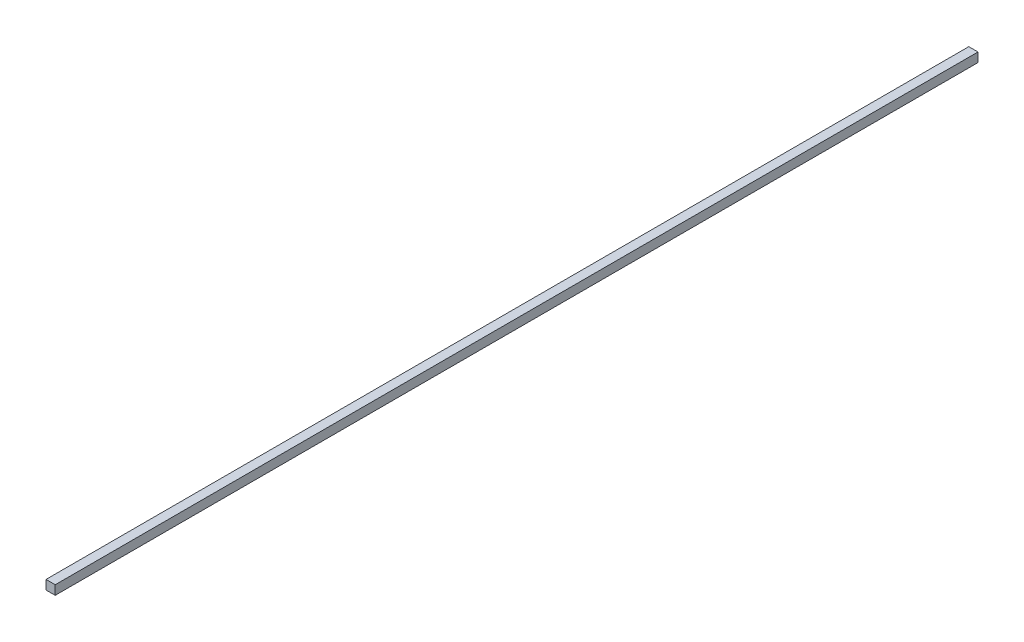
ISO-10303-21;
HEADER;
FILE_DESCRIPTION(('STEP AP214'),'2;1');
FILE_NAME('part.step','',(''),(''),'','','');
FILE_SCHEMA(('AUTOMOTIVE_DESIGN { 1 0 10303 214 1 1 1 1 }'));
ENDSEC;
DATA;
#1=APPLICATION_CONTEXT('core data for automotive mechanical design processes');
#2=APPLICATION_PROTOCOL_DEFINITION('international standard','automotive_design',2000,#1);
#3=PRODUCT_CONTEXT('',#1,'mechanical');
#4=PRODUCT('Part','Part','',(#3));
#5=PRODUCT_RELATED_PRODUCT_CATEGORY('part','',(#4));
#6=PRODUCT_DEFINITION_FORMATION('','',#4);
#7=PRODUCT_DEFINITION_CONTEXT('part definition',#1,'design');
#8=PRODUCT_DEFINITION('design','',#6,#7);
#9=PRODUCT_DEFINITION_SHAPE('','',#8);
#10=(LENGTH_UNIT() NAMED_UNIT(*) SI_UNIT(.MILLI.,.METRE.));
#11=(NAMED_UNIT(*) PLANE_ANGLE_UNIT() SI_UNIT($,.RADIAN.));
#12=(NAMED_UNIT(*) SI_UNIT($,.STERADIAN.) SOLID_ANGLE_UNIT());
#13=UNCERTAINTY_MEASURE_WITH_UNIT(LENGTH_MEASURE(1.E-05),#10,'distance_accuracy_value','');
#14=(GEOMETRIC_REPRESENTATION_CONTEXT(3) GLOBAL_UNCERTAINTY_ASSIGNED_CONTEXT((#13)) GLOBAL_UNIT_ASSIGNED_CONTEXT((#10,
#11,#12)) REPRESENTATION_CONTEXT('',''));
#15=CARTESIAN_POINT('',(0.,0.,0.));
#16=DIRECTION('',(0.,0.,1.));
#17=DIRECTION('',(1.,0.,0.));
#18=AXIS2_PLACEMENT_3D('',#15,#16,#17);
#19=CARTESIAN_POINT('',(3.8,-3.8,762.));
#20=DIRECTION('',(-1.,0.,0.));
#21=DIRECTION('',(0.,0.,1.));
#22=AXIS2_PLACEMENT_3D('',#19,#20,#21);
#23=PLANE('',#22);
#24=DIRECTION('',(0.,1.,0.));
#25=VECTOR('',#24,1.);
#26=CARTESIAN_POINT('',(3.8,-3.8,0.));
#27=LINE('',#26,#25);
#28=CARTESIAN_POINT('',(3.8,-3.8,0.));
#29=VERTEX_POINT('',#28);
#30=CARTESIAN_POINT('',(3.8,3.8,0.));
#31=VERTEX_POINT('',#30);
#32=EDGE_CURVE('E97',#29,#31,#27,.T.);
#33=ORIENTED_EDGE('',*,*,#32,.T.);
#34=DIRECTION('',(0.,0.,-1.));
#35=VECTOR('',#34,1.);
#36=CARTESIAN_POINT('',(3.8,3.8,762.));
#37=LINE('',#36,#35);
#38=CARTESIAN_POINT('',(3.8,3.8,762.));
#39=VERTEX_POINT('',#38);
#40=EDGE_CURVE('E11',#39,#31,#37,.T.);
#41=ORIENTED_EDGE('',*,*,#40,.F.);
#42=DIRECTION('',(0.,1.,0.));
#43=VECTOR('',#42,1.);
#44=CARTESIAN_POINT('',(3.8,-3.8,762.));
#45=LINE('',#44,#43);
#46=CARTESIAN_POINT('',(3.8,-3.8,762.));
#47=VERTEX_POINT('',#46);
#48=EDGE_CURVE('E85',#47,#39,#45,.T.);
#49=ORIENTED_EDGE('',*,*,#48,.F.);
#50=DIRECTION('',(0.,0.,-1.));
#51=VECTOR('',#50,1.);
#52=CARTESIAN_POINT('',(3.8,-3.8,762.));
#53=LINE('',#52,#51);
#54=EDGE_CURVE('E93',#47,#29,#53,.T.);
#55=ORIENTED_EDGE('',*,*,#54,.T.);
#56=EDGE_LOOP('',(#33,#41,#49,#55));
#57=FACE_BOUND('',#56,.T.);
#58=ADVANCED_FACE('F34',(#57),#23,.F.);
#59=CARTESIAN_POINT('',(-3.8,3.8,762.));
#60=DIRECTION('',(0.,-1.,0.));
#61=DIRECTION('',(0.,0.,-1.));
#62=AXIS2_PLACEMENT_3D('',#59,#60,#61);
#63=PLANE('',#62);
#64=DIRECTION('',(-1.,0.,0.));
#65=VECTOR('',#64,1.);
#66=CARTESIAN_POINT('',(-3.8,3.8,0.));
#67=LINE('',#66,#65);
#68=CARTESIAN_POINT('',(-3.8,3.8,0.));
#69=VERTEX_POINT('',#68);
#70=EDGE_CURVE('E89',#31,#69,#67,.T.);
#71=ORIENTED_EDGE('',*,*,#70,.T.);
#72=DIRECTION('',(0.,0.,-1.));
#73=VECTOR('',#72,1.);
#74=CARTESIAN_POINT('',(-3.8,3.8,762.));
#75=LINE('',#74,#73);
#76=CARTESIAN_POINT('',(-3.8,3.8,762.));
#77=VERTEX_POINT('',#76);
#78=EDGE_CURVE('E42',#77,#69,#75,.T.);
#79=ORIENTED_EDGE('',*,*,#78,.F.);
#80=DIRECTION('',(-1.,0.,0.));
#81=VECTOR('',#80,1.);
#82=CARTESIAN_POINT('',(-3.8,3.8,762.));
#83=LINE('',#82,#81);
#84=EDGE_CURVE('E80',#39,#77,#83,.T.);
#85=ORIENTED_EDGE('',*,*,#84,.F.);
#86=ORIENTED_EDGE('',*,*,#40,.T.);
#87=EDGE_LOOP('',(#71,#79,#85,#86));
#88=FACE_BOUND('',#87,.T.);
#89=ADVANCED_FACE('F88',(#88),#63,.F.);
#90=CARTESIAN_POINT('',(-3.8,-3.8,762.));
#91=DIRECTION('',(1.,0.,0.));
#92=DIRECTION('',(0.,0.,-1.));
#93=AXIS2_PLACEMENT_3D('',#90,#91,#92);
#94=PLANE('',#93);
#95=DIRECTION('',(0.,-1.,0.));
#96=VECTOR('',#95,1.);
#97=CARTESIAN_POINT('',(-3.8,-3.8,0.));
#98=LINE('',#97,#96);
#99=CARTESIAN_POINT('',(-3.8,-3.8,0.));
#100=VERTEX_POINT('',#99);
#101=EDGE_CURVE('E67',#69,#100,#98,.T.);
#102=ORIENTED_EDGE('',*,*,#101,.T.);
#103=DIRECTION('',(0.,0.,-1.));
#104=VECTOR('',#103,1.);
#105=CARTESIAN_POINT('',(-3.8,-3.8,762.));
#106=LINE('',#105,#104);
#107=CARTESIAN_POINT('',(-3.8,-3.8,762.));
#108=VERTEX_POINT('',#107);
#109=EDGE_CURVE('E90',#108,#100,#106,.T.);
#110=ORIENTED_EDGE('',*,*,#109,.F.);
#111=DIRECTION('',(0.,-1.,0.));
#112=VECTOR('',#111,1.);
#113=CARTESIAN_POINT('',(-3.8,-3.8,762.));
#114=LINE('',#113,#112);
#115=EDGE_CURVE('E83',#77,#108,#114,.T.);
#116=ORIENTED_EDGE('',*,*,#115,.F.);
#117=ORIENTED_EDGE('',*,*,#78,.T.);
#118=EDGE_LOOP('',(#102,#110,#116,#117));
#119=FACE_BOUND('',#118,.T.);
#120=ADVANCED_FACE('F91',(#119),#94,.F.);
#121=CARTESIAN_POINT('',(-3.8,-3.8,762.));
#122=DIRECTION('',(0.,1.,0.));
#123=DIRECTION('',(0.,0.,1.));
#124=AXIS2_PLACEMENT_3D('',#121,#122,#123);
#125=PLANE('',#124);
#126=DIRECTION('',(1.,0.,0.));
#127=VECTOR('',#126,1.);
#128=CARTESIAN_POINT('',(-3.8,-3.8,0.));
#129=LINE('',#128,#127);
#130=EDGE_CURVE('E73',#100,#29,#129,.T.);
#131=ORIENTED_EDGE('',*,*,#130,.T.);
#132=ORIENTED_EDGE('',*,*,#54,.F.);
#133=DIRECTION('',(1.,0.,0.));
#134=VECTOR('',#133,1.);
#135=CARTESIAN_POINT('',(-3.8,-3.8,762.));
#136=LINE('',#135,#134);
#137=EDGE_CURVE('E50',#108,#47,#136,.T.);
#138=ORIENTED_EDGE('',*,*,#137,.F.);
#139=ORIENTED_EDGE('',*,*,#109,.T.);
#140=EDGE_LOOP('',(#131,#132,#138,#139));
#141=FACE_BOUND('',#140,.T.);
#142=ADVANCED_FACE('F104',(#141),#125,.F.);
#143=CARTESIAN_POINT('',(0.,0.,762.));
#144=DIRECTION('',(0.,0.,-1.));
#145=DIRECTION('',(-1.,0.,0.));
#146=AXIS2_PLACEMENT_3D('',#143,#144,#145);
#147=PLANE('',#146);
#148=ORIENTED_EDGE('',*,*,#48,.T.);
#149=ORIENTED_EDGE('',*,*,#84,.T.);
#150=ORIENTED_EDGE('',*,*,#115,.T.);
#151=ORIENTED_EDGE('',*,*,#137,.T.);
#152=EDGE_LOOP('',(#148,#149,#150,#151));
#153=FACE_BOUND('',#152,.T.);
#154=ADVANCED_FACE('F81',(#153),#147,.F.);
#155=CARTESIAN_POINT('',(0.,0.,0.));
#156=DIRECTION('',(0.,0.,-1.));
#157=DIRECTION('',(-1.,0.,0.));
#158=AXIS2_PLACEMENT_3D('',#155,#156,#157);
#159=PLANE('',#158);
#160=ORIENTED_EDGE('',*,*,#32,.F.);
#161=ORIENTED_EDGE('',*,*,#130,.F.);
#162=ORIENTED_EDGE('',*,*,#101,.F.);
#163=ORIENTED_EDGE('',*,*,#70,.F.);
#164=EDGE_LOOP('',(#160,#161,#162,#163));
#165=FACE_BOUND('',#164,.T.);
#166=ADVANCED_FACE('F107',(#165),#159,.T.);
#167=CLOSED_SHELL('',(#58,#89,#120,#142,#154,#166));
#168=MANIFOLD_SOLID_BREP('B2',#167);
#169=ADVANCED_BREP_SHAPE_REPRESENTATION('',(#18,#168),#14);
#170=SHAPE_DEFINITION_REPRESENTATION(#9,#169);
ENDSEC;
END-ISO-10303-21;
